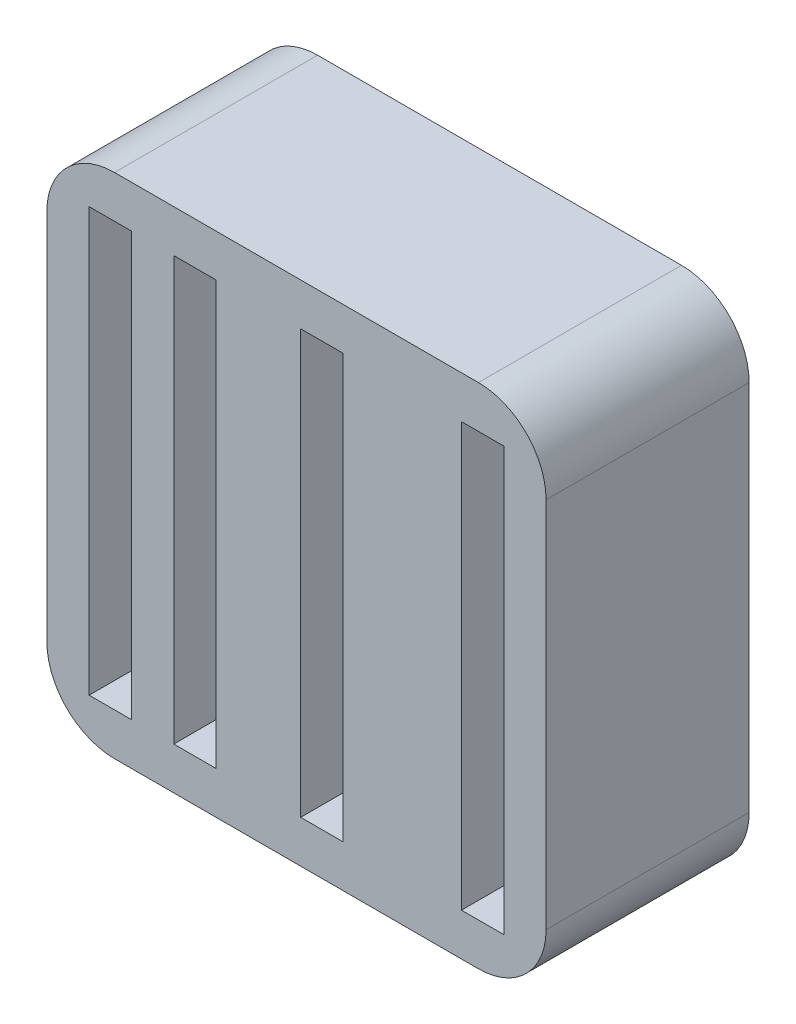
ISO-10303-21;
HEADER;
FILE_DESCRIPTION(('STEP AP214'),'2;1');
FILE_NAME('part.step','',(''),(''),'','','');
FILE_SCHEMA(('AUTOMOTIVE_DESIGN { 1 0 10303 214 1 1 1 1 }'));
ENDSEC;
DATA;
#1=APPLICATION_CONTEXT('core data for automotive mechanical design processes');
#2=APPLICATION_PROTOCOL_DEFINITION('international standard','automotive_design',2000,#1);
#3=PRODUCT_CONTEXT('',#1,'mechanical');
#4=PRODUCT('Part','Part','',(#3));
#5=PRODUCT_RELATED_PRODUCT_CATEGORY('part','',(#4));
#6=PRODUCT_DEFINITION_FORMATION('','',#4);
#7=PRODUCT_DEFINITION_CONTEXT('part definition',#1,'design');
#8=PRODUCT_DEFINITION('design','',#6,#7);
#9=PRODUCT_DEFINITION_SHAPE('','',#8);
#10=(LENGTH_UNIT() NAMED_UNIT(*) SI_UNIT(.MILLI.,.METRE.));
#11=(NAMED_UNIT(*) PLANE_ANGLE_UNIT() SI_UNIT($,.RADIAN.));
#12=(NAMED_UNIT(*) SI_UNIT($,.STERADIAN.) SOLID_ANGLE_UNIT());
#13=UNCERTAINTY_MEASURE_WITH_UNIT(LENGTH_MEASURE(1.E-05),#10,'distance_accuracy_value','');
#14=(GEOMETRIC_REPRESENTATION_CONTEXT(3) GLOBAL_UNCERTAINTY_ASSIGNED_CONTEXT((#13)) GLOBAL_UNIT_ASSIGNED_CONTEXT((#10,
#11,#12)) REPRESENTATION_CONTEXT('',''));
#15=CARTESIAN_POINT('',(0.,0.,0.));
#16=DIRECTION('',(0.,0.,1.));
#17=DIRECTION('',(1.,0.,0.));
#18=AXIS2_PLACEMENT_3D('',#15,#16,#17);
#19=CARTESIAN_POINT('',(-10.472049689441,0.,2.));
#20=DIRECTION('',(1.,0.,0.));
#21=DIRECTION('',(0.,1.,0.));
#22=AXIS2_PLACEMENT_3D('',#19,#20,#21);
#23=PLANE('',#22);
#24=DIRECTION('',(0.,-1.,0.));
#25=VECTOR('',#24,1.);
#26=CARTESIAN_POINT('',(-10.472049689441,0.,0.));
#27=LINE('',#26,#25);
#28=CARTESIAN_POINT('',(-10.472049689441,4.20186335403726,0.));
#29=VERTEX_POINT('',#28);
#30=CARTESIAN_POINT('',(-10.472049689441,-17.7981366459627,0.));
#31=VERTEX_POINT('',#30);
#32=EDGE_CURVE('E346',#29,#31,#27,.T.);
#33=ORIENTED_EDGE('',*,*,#32,.T.);
#34=DIRECTION('',(0.,0.,-1.));
#35=VECTOR('',#34,1.);
#36=CARTESIAN_POINT('',(-10.472049689441,-17.7981366459627,2.));
#37=LINE('',#36,#35);
#38=CARTESIAN_POINT('',(-10.472049689441,-17.7981366459627,12.));
#39=VERTEX_POINT('',#38);
#40=EDGE_CURVE('E52',#31,#39,#37,.F.);
#41=ORIENTED_EDGE('',*,*,#40,.T.);
#42=DIRECTION('',(0.,-1.,0.));
#43=VECTOR('',#42,1.);
#44=CARTESIAN_POINT('',(-10.472049689441,0.,12.));
#45=LINE('',#44,#43);
#46=CARTESIAN_POINT('',(-10.472049689441,4.20186335403726,12.));
#47=VERTEX_POINT('',#46);
#48=EDGE_CURVE('E236',#47,#39,#45,.T.);
#49=ORIENTED_EDGE('',*,*,#48,.F.);
#50=DIRECTION('',(0.,0.,-1.));
#51=VECTOR('',#50,1.);
#52=CARTESIAN_POINT('',(-10.472049689441,4.20186335403726,0.));
#53=LINE('',#52,#51);
#54=EDGE_CURVE('E382',#47,#29,#53,.T.);
#55=ORIENTED_EDGE('',*,*,#54,.T.);
#56=EDGE_LOOP('',(#33,#41,#49,#55));
#57=FACE_BOUND('',#56,.T.);
#58=ADVANCED_FACE('F37',(#57),#23,.F.);
#59=CARTESIAN_POINT('',(0.,-21.7981366459627,2.));
#60=DIRECTION('',(0.,1.,0.));
#61=DIRECTION('',(0.,0.,1.));
#62=AXIS2_PLACEMENT_3D('',#59,#60,#61);
#63=PLANE('',#62);
#64=DIRECTION('',(1.,0.,0.));
#65=VECTOR('',#64,1.);
#66=CARTESIAN_POINT('',(0.,-21.7981366459627,0.));
#67=LINE('',#66,#65);
#68=CARTESIAN_POINT('',(-6.47204968944099,-21.7981366459627,0.));
#69=VERTEX_POINT('',#68);
#70=CARTESIAN_POINT('',(15.027950310559,-21.7981366459627,0.));
#71=VERTEX_POINT('',#70);
#72=EDGE_CURVE('E348',#69,#71,#67,.T.);
#73=ORIENTED_EDGE('',*,*,#72,.T.);
#74=DIRECTION('',(0.,0.,-1.));
#75=VECTOR('',#74,1.);
#76=CARTESIAN_POINT('',(15.027950310559,-21.7981366459627,12.));
#77=LINE('',#76,#75);
#78=CARTESIAN_POINT('',(15.027950310559,-21.7981366459627,12.));
#79=VERTEX_POINT('',#78);
#80=EDGE_CURVE('E373',#71,#79,#77,.F.);
#81=ORIENTED_EDGE('',*,*,#80,.T.);
#82=DIRECTION('',(1.,0.,0.));
#83=VECTOR('',#82,1.);
#84=CARTESIAN_POINT('',(0.,-21.7981366459627,12.));
#85=LINE('',#84,#83);
#86=CARTESIAN_POINT('',(-6.47204968944099,-21.7981366459627,12.));
#87=VERTEX_POINT('',#86);
#88=EDGE_CURVE('E238',#87,#79,#85,.T.);
#89=ORIENTED_EDGE('',*,*,#88,.F.);
#90=DIRECTION('',(0.,0.,-1.));
#91=VECTOR('',#90,1.);
#92=CARTESIAN_POINT('',(-6.47204968944099,-21.7981366459627,2.));
#93=LINE('',#92,#91);
#94=EDGE_CURVE('E370',#87,#69,#93,.T.);
#95=ORIENTED_EDGE('',*,*,#94,.T.);
#96=EDGE_LOOP('',(#73,#81,#89,#95));
#97=FACE_BOUND('',#96,.T.);
#98=ADVANCED_FACE('F408',(#97),#63,.F.);
#99=CARTESIAN_POINT('',(19.027950310559,0.,2.));
#100=DIRECTION('',(1.,0.,0.));
#101=DIRECTION('',(0.,1.,0.));
#102=AXIS2_PLACEMENT_3D('',#99,#100,#101);
#103=PLANE('',#102);
#104=DIRECTION('',(0.,-1.,0.));
#105=VECTOR('',#104,1.);
#106=CARTESIAN_POINT('',(19.027950310559,0.,12.));
#107=LINE('',#106,#105);
#108=CARTESIAN_POINT('',(19.027950310559,4.20186335403727,12.));
#109=VERTEX_POINT('',#108);
#110=CARTESIAN_POINT('',(19.027950310559,-17.7981366459627,12.));
#111=VERTEX_POINT('',#110);
#112=EDGE_CURVE('E230',#109,#111,#107,.T.);
#113=ORIENTED_EDGE('',*,*,#112,.T.);
#114=DIRECTION('',(0.,0.,-1.));
#115=VECTOR('',#114,1.);
#116=CARTESIAN_POINT('',(19.027950310559,-17.7981366459627,0.));
#117=LINE('',#116,#115);
#118=CARTESIAN_POINT('',(19.027950310559,-17.7981366459627,0.));
#119=VERTEX_POINT('',#118);
#120=EDGE_CURVE('E359',#111,#119,#117,.T.);
#121=ORIENTED_EDGE('',*,*,#120,.T.);
#122=DIRECTION('',(0.,-1.,0.));
#123=VECTOR('',#122,1.);
#124=CARTESIAN_POINT('',(19.027950310559,0.,0.));
#125=LINE('',#124,#123);
#126=CARTESIAN_POINT('',(19.027950310559,4.20186335403727,0.));
#127=VERTEX_POINT('',#126);
#128=EDGE_CURVE('E351',#127,#119,#125,.T.);
#129=ORIENTED_EDGE('',*,*,#128,.F.);
#130=DIRECTION('',(0.,0.,-1.));
#131=VECTOR('',#130,1.);
#132=CARTESIAN_POINT('',(19.027950310559,4.20186335403727,2.));
#133=LINE('',#132,#131);
#134=EDGE_CURVE('E357',#127,#109,#133,.F.);
#135=ORIENTED_EDGE('',*,*,#134,.T.);
#136=EDGE_LOOP('',(#113,#121,#129,#135));
#137=FACE_BOUND('',#136,.T.);
#138=ADVANCED_FACE('F415',(#137),#103,.T.);
#139=CARTESIAN_POINT('',(0.,8.20186335403726,2.));
#140=DIRECTION('',(0.,1.,0.));
#141=DIRECTION('',(0.,0.,1.));
#142=AXIS2_PLACEMENT_3D('',#139,#140,#141);
#143=PLANE('',#142);
#144=DIRECTION('',(1.,0.,0.));
#145=VECTOR('',#144,1.);
#146=CARTESIAN_POINT('',(0.,8.20186335403726,0.));
#147=LINE('',#146,#145);
#148=CARTESIAN_POINT('',(-6.47204968944099,8.20186335403726,0.));
#149=VERTEX_POINT('',#148);
#150=CARTESIAN_POINT('',(15.027950310559,8.20186335403726,0.));
#151=VERTEX_POINT('',#150);
#152=EDGE_CURVE('E354',#149,#151,#147,.T.);
#153=ORIENTED_EDGE('',*,*,#152,.F.);
#154=DIRECTION('',(0.,0.,-1.));
#155=VECTOR('',#154,1.);
#156=CARTESIAN_POINT('',(-6.47204968944099,8.20186335403726,12.));
#157=LINE('',#156,#155);
#158=CARTESIAN_POINT('',(-6.47204968944099,8.20186335403726,12.));
#159=VERTEX_POINT('',#158);
#160=EDGE_CURVE('E11',#149,#159,#157,.F.);
#161=ORIENTED_EDGE('',*,*,#160,.T.);
#162=DIRECTION('',(1.,0.,0.));
#163=VECTOR('',#162,1.);
#164=CARTESIAN_POINT('',(0.,8.20186335403726,12.));
#165=LINE('',#164,#163);
#166=CARTESIAN_POINT('',(15.027950310559,8.20186335403726,12.));
#167=VERTEX_POINT('',#166);
#168=EDGE_CURVE('E233',#159,#167,#165,.T.);
#169=ORIENTED_EDGE('',*,*,#168,.T.);
#170=DIRECTION('',(0.,0.,-1.));
#171=VECTOR('',#170,1.);
#172=CARTESIAN_POINT('',(15.027950310559,8.20186335403726,2.));
#173=LINE('',#172,#171);
#174=EDGE_CURVE('E45',#167,#151,#173,.T.);
#175=ORIENTED_EDGE('',*,*,#174,.T.);
#176=EDGE_LOOP('',(#153,#161,#169,#175));
#177=FACE_BOUND('',#176,.T.);
#178=ADVANCED_FACE('F389',(#177),#143,.T.);
#179=CARTESIAN_POINT('',(0.,0.,0.));
#180=DIRECTION('',(0.,0.,1.));
#181=DIRECTION('',(1.,0.,0.));
#182=AXIS2_PLACEMENT_3D('',#179,#180,#181);
#183=PLANE('',#182);
#184=ORIENTED_EDGE('',*,*,#128,.T.);
#185=CARTESIAN_POINT('',(15.027950310559,-17.7981366459627,0.));
#186=DIRECTION('',(0.,0.,1.));
#187=DIRECTION('',(1.,0.,0.));
#188=AXIS2_PLACEMENT_3D('',#185,#186,#187);
#189=CIRCLE('',#188,4.);
#190=EDGE_CURVE('E368',#119,#71,#189,.F.);
#191=ORIENTED_EDGE('',*,*,#190,.T.);
#192=ORIENTED_EDGE('',*,*,#72,.F.);
#193=CARTESIAN_POINT('',(-6.47204968944099,-17.7981366459627,0.));
#194=DIRECTION('',(0.,0.,1.));
#195=DIRECTION('',(1.,0.,0.));
#196=AXIS2_PLACEMENT_3D('',#193,#194,#195);
#197=CIRCLE('',#196,4.);
#198=EDGE_CURVE('E366',#69,#31,#197,.F.);
#199=ORIENTED_EDGE('',*,*,#198,.T.);
#200=ORIENTED_EDGE('',*,*,#32,.F.);
#201=CARTESIAN_POINT('',(-6.47204968944099,4.20186335403726,0.));
#202=DIRECTION('',(0.,0.,1.));
#203=DIRECTION('',(1.,0.,0.));
#204=AXIS2_PLACEMENT_3D('',#201,#202,#203);
#205=CIRCLE('',#204,4.);
#206=EDGE_CURVE('E364',#29,#149,#205,.F.);
#207=ORIENTED_EDGE('',*,*,#206,.T.);
#208=ORIENTED_EDGE('',*,*,#152,.T.);
#209=CARTESIAN_POINT('',(15.027950310559,4.20186335403726,0.));
#210=DIRECTION('',(0.,0.,1.));
#211=DIRECTION('',(1.,0.,0.));
#212=AXIS2_PLACEMENT_3D('',#209,#210,#211);
#213=CIRCLE('',#212,4.);
#214=EDGE_CURVE('E362',#151,#127,#213,.F.);
#215=ORIENTED_EDGE('',*,*,#214,.T.);
#216=EDGE_LOOP('',(#184,#191,#192,#199,#200,#207,#208,#215));
#217=FACE_BOUND('',#216,.T.);
#218=ADVANCED_FACE('F394',(#217),#183,.F.);
#219=CARTESIAN_POINT('',(0.,5.70186335403726,12.));
#220=DIRECTION('',(0.,1.,0.));
#221=DIRECTION('',(0.,0.,1.));
#222=AXIS2_PLACEMENT_3D('',#219,#220,#221);
#223=PLANE('',#222);
#224=DIRECTION('',(-1.,0.,0.));
#225=VECTOR('',#224,1.);
#226=CARTESIAN_POINT('',(0.,5.70186335403726,2.));
#227=LINE('',#226,#225);
#228=CARTESIAN_POINT('',(-0.47204968944099,5.70186335403726,2.));
#229=VERTEX_POINT('',#228);
#230=CARTESIAN_POINT('',(-2.97204968944099,5.70186335403726,2.));
#231=VERTEX_POINT('',#230);
#232=EDGE_CURVE('E344',#229,#231,#227,.T.);
#233=ORIENTED_EDGE('',*,*,#232,.F.);
#234=DIRECTION('',(0.,0.,-1.));
#235=VECTOR('',#234,1.);
#236=CARTESIAN_POINT('',(-0.47204968944099,5.70186335403726,12.));
#237=LINE('',#236,#235);
#238=CARTESIAN_POINT('',(-0.47204968944099,5.70186335403726,12.));
#239=VERTEX_POINT('',#238);
#240=EDGE_CURVE('E278',#239,#229,#237,.T.);
#241=ORIENTED_EDGE('',*,*,#240,.F.);
#242=DIRECTION('',(1.,0.,0.));
#243=VECTOR('',#242,1.);
#244=CARTESIAN_POINT('',(0.,5.70186335403726,12.));
#245=LINE('',#244,#243);
#246=CARTESIAN_POINT('',(-2.97204968944099,5.70186335403726,12.));
#247=VERTEX_POINT('',#246);
#248=EDGE_CURVE('E221',#247,#239,#245,.T.);
#249=ORIENTED_EDGE('',*,*,#248,.F.);
#250=DIRECTION('',(0.,0.,-1.));
#251=VECTOR('',#250,1.);
#252=CARTESIAN_POINT('',(-2.97204968944099,5.70186335403726,12.));
#253=LINE('',#252,#251);
#254=EDGE_CURVE('E268',#247,#231,#253,.T.);
#255=ORIENTED_EDGE('',*,*,#254,.T.);
#256=EDGE_LOOP('',(#233,#241,#249,#255));
#257=FACE_BOUND('',#256,.T.);
#258=ADVANCED_FACE('F532',(#257),#223,.F.);
#259=CARTESIAN_POINT('',(-0.472049689440989,0.,12.));
#260=DIRECTION('',(1.,0.,0.));
#261=DIRECTION('',(0.,1.,0.));
#262=AXIS2_PLACEMENT_3D('',#259,#260,#261);
#263=PLANE('',#262);
#264=DIRECTION('',(0.,1.,0.));
#265=VECTOR('',#264,1.);
#266=CARTESIAN_POINT('',(-0.472049689440989,0.,2.));
#267=LINE('',#266,#265);
#268=CARTESIAN_POINT('',(-0.472049689440987,-19.2981366459627,2.));
#269=VERTEX_POINT('',#268);
#270=EDGE_CURVE('E342',#269,#229,#267,.T.);
#271=ORIENTED_EDGE('',*,*,#270,.F.);
#272=DIRECTION('',(0.,0.,-1.));
#273=VECTOR('',#272,1.);
#274=CARTESIAN_POINT('',(-0.472049689440987,-19.2981366459627,12.));
#275=LINE('',#274,#273);
#276=CARTESIAN_POINT('',(-0.472049689440987,-19.2981366459627,12.));
#277=VERTEX_POINT('',#276);
#278=EDGE_CURVE('E275',#277,#269,#275,.T.);
#279=ORIENTED_EDGE('',*,*,#278,.F.);
#280=DIRECTION('',(0.,-1.,0.));
#281=VECTOR('',#280,1.);
#282=CARTESIAN_POINT('',(-0.472049689440989,0.,12.));
#283=LINE('',#282,#281);
#284=EDGE_CURVE('E259',#239,#277,#283,.T.);
#285=ORIENTED_EDGE('',*,*,#284,.F.);
#286=ORIENTED_EDGE('',*,*,#240,.T.);
#287=EDGE_LOOP('',(#271,#279,#285,#286));
#288=FACE_BOUND('',#287,.T.);
#289=ADVANCED_FACE('F608',(#288),#263,.F.);
#290=CARTESIAN_POINT('',(0.,-19.2981366459627,12.));
#291=DIRECTION('',(0.,1.,0.));
#292=DIRECTION('',(0.,0.,1.));
#293=AXIS2_PLACEMENT_3D('',#290,#291,#292);
#294=PLANE('',#293);
#295=ORIENTED_EDGE('',*,*,#278,.T.);
#296=DIRECTION('',(-1.,0.,0.));
#297=VECTOR('',#296,1.);
#298=CARTESIAN_POINT('',(0.,-19.2981366459627,2.));
#299=LINE('',#298,#297);
#300=CARTESIAN_POINT('',(-2.97204968944099,-19.2981366459627,2.));
#301=VERTEX_POINT('',#300);
#302=EDGE_CURVE('E339',#269,#301,#299,.T.);
#303=ORIENTED_EDGE('',*,*,#302,.T.);
#304=DIRECTION('',(0.,0.,-1.));
#305=VECTOR('',#304,1.);
#306=CARTESIAN_POINT('',(-2.97204968944099,-19.2981366459627,12.));
#307=LINE('',#306,#305);
#308=CARTESIAN_POINT('',(-2.97204968944099,-19.2981366459627,12.));
#309=VERTEX_POINT('',#308);
#310=EDGE_CURVE('E271',#309,#301,#307,.T.);
#311=ORIENTED_EDGE('',*,*,#310,.F.);
#312=DIRECTION('',(1.,0.,0.));
#313=VECTOR('',#312,1.);
#314=CARTESIAN_POINT('',(0.,-19.2981366459627,12.));
#315=LINE('',#314,#313);
#316=EDGE_CURVE('E261',#309,#277,#315,.T.);
#317=ORIENTED_EDGE('',*,*,#316,.T.);
#318=EDGE_LOOP('',(#295,#303,#311,#317));
#319=FACE_BOUND('',#318,.T.);
#320=ADVANCED_FACE('F598',(#319),#294,.T.);
#321=CARTESIAN_POINT('',(4.52795031055901,0.,12.));
#322=DIRECTION('',(-1.,0.,0.));
#323=DIRECTION('',(0.,0.,1.));
#324=AXIS2_PLACEMENT_3D('',#321,#322,#323);
#325=PLANE('',#324);
#326=DIRECTION('',(0.,-1.,0.));
#327=VECTOR('',#326,1.);
#328=CARTESIAN_POINT('',(4.52795031055901,0.,2.));
#329=LINE('',#328,#327);
#330=CARTESIAN_POINT('',(4.52795031055901,5.70186335403726,2.));
#331=VERTEX_POINT('',#330);
#332=CARTESIAN_POINT('',(4.52795031055901,-19.2981366459627,2.));
#333=VERTEX_POINT('',#332);
#334=EDGE_CURVE('E337',#331,#333,#329,.T.);
#335=ORIENTED_EDGE('',*,*,#334,.F.);
#336=DIRECTION('',(0.,0.,-1.));
#337=VECTOR('',#336,1.);
#338=CARTESIAN_POINT('',(4.52795031055901,5.70186335403726,12.));
#339=LINE('',#338,#337);
#340=CARTESIAN_POINT('',(4.52795031055901,5.70186335403726,12.));
#341=VERTEX_POINT('',#340);
#342=EDGE_CURVE('E272',#341,#331,#339,.T.);
#343=ORIENTED_EDGE('',*,*,#342,.F.);
#344=DIRECTION('',(0.,1.,0.));
#345=VECTOR('',#344,1.);
#346=CARTESIAN_POINT('',(4.52795031055901,0.,12.));
#347=LINE('',#346,#345);
#348=CARTESIAN_POINT('',(4.52795031055901,-19.2981366459627,12.));
#349=VERTEX_POINT('',#348);
#350=EDGE_CURVE('E249',#349,#341,#347,.T.);
#351=ORIENTED_EDGE('',*,*,#350,.F.);
#352=DIRECTION('',(0.,0.,-1.));
#353=VECTOR('',#352,1.);
#354=CARTESIAN_POINT('',(4.52795031055901,-19.2981366459627,12.));
#355=LINE('',#354,#353);
#356=EDGE_CURVE('E282',#349,#333,#355,.T.);
#357=ORIENTED_EDGE('',*,*,#356,.T.);
#358=EDGE_LOOP('',(#335,#343,#351,#357));
#359=FACE_BOUND('',#358,.T.);
#360=ADVANCED_FACE('F589',(#359),#325,.F.);
#361=DIRECTION('',(-1.,0.,0.));
#362=VECTOR('',#361,1.);
#363=CARTESIAN_POINT('',(0.,5.70186335403726,2.));
#364=LINE('',#363,#362);
#365=CARTESIAN_POINT('',(7.02795031055901,5.70186335403726,2.));
#366=VERTEX_POINT('',#365);
#367=EDGE_CURVE('E335',#366,#331,#364,.T.);
#368=ORIENTED_EDGE('',*,*,#367,.F.);
#369=DIRECTION('',(0.,0.,-1.));
#370=VECTOR('',#369,1.);
#371=CARTESIAN_POINT('',(7.02795031055901,5.70186335403726,12.));
#372=LINE('',#371,#370);
#373=CARTESIAN_POINT('',(7.02795031055901,5.70186335403726,12.));
#374=VERTEX_POINT('',#373);
#375=EDGE_CURVE('E289',#374,#366,#372,.T.);
#376=ORIENTED_EDGE('',*,*,#375,.F.);
#377=EDGE_CURVE('E252',#341,#374,#245,.T.);
#378=ORIENTED_EDGE('',*,*,#377,.F.);
#379=ORIENTED_EDGE('',*,*,#342,.T.);
#380=EDGE_LOOP('',(#368,#376,#378,#379));
#381=FACE_BOUND('',#380,.T.);
#382=ADVANCED_FACE('F561',(#381),#223,.F.);
#383=CARTESIAN_POINT('',(7.02795031055901,0.,12.));
#384=DIRECTION('',(-1.,0.,0.));
#385=DIRECTION('',(0.,0.,1.));
#386=AXIS2_PLACEMENT_3D('',#383,#384,#385);
#387=PLANE('',#386);
#388=ORIENTED_EDGE('',*,*,#375,.T.);
#389=DIRECTION('',(0.,-1.,0.));
#390=VECTOR('',#389,1.);
#391=CARTESIAN_POINT('',(7.02795031055901,0.,2.));
#392=LINE('',#391,#390);
#393=CARTESIAN_POINT('',(7.02795031055901,-19.2981366459627,2.));
#394=VERTEX_POINT('',#393);
#395=EDGE_CURVE('E332',#366,#394,#392,.T.);
#396=ORIENTED_EDGE('',*,*,#395,.T.);
#397=DIRECTION('',(0.,0.,-1.));
#398=VECTOR('',#397,1.);
#399=CARTESIAN_POINT('',(7.02795031055901,-19.2981366459627,12.));
#400=LINE('',#399,#398);
#401=CARTESIAN_POINT('',(7.02795031055901,-19.2981366459627,12.));
#402=VERTEX_POINT('',#401);
#403=EDGE_CURVE('E285',#402,#394,#400,.T.);
#404=ORIENTED_EDGE('',*,*,#403,.F.);
#405=DIRECTION('',(0.,1.,0.));
#406=VECTOR('',#405,1.);
#407=CARTESIAN_POINT('',(7.02795031055901,0.,12.));
#408=LINE('',#407,#406);
#409=EDGE_CURVE('E253',#402,#374,#408,.T.);
#410=ORIENTED_EDGE('',*,*,#409,.T.);
#411=EDGE_LOOP('',(#388,#396,#404,#410));
#412=FACE_BOUND('',#411,.T.);
#413=ADVANCED_FACE('F569',(#412),#387,.T.);
#414=CARTESIAN_POINT('',(14.027950310559,0.,12.));
#415=DIRECTION('',(1.,0.,0.));
#416=DIRECTION('',(0.,1.,0.));
#417=AXIS2_PLACEMENT_3D('',#414,#415,#416);
#418=PLANE('',#417);
#419=DIRECTION('',(0.,0.,-1.));
#420=VECTOR('',#419,1.);
#421=CARTESIAN_POINT('',(14.027950310559,-19.2981366459627,12.));
#422=LINE('',#421,#420);
#423=CARTESIAN_POINT('',(14.027950310559,-19.2981366459627,12.));
#424=VERTEX_POINT('',#423);
#425=CARTESIAN_POINT('',(14.027950310559,-19.2981366459627,2.));
#426=VERTEX_POINT('',#425);
#427=EDGE_CURVE('E210',#424,#426,#422,.T.);
#428=ORIENTED_EDGE('',*,*,#427,.T.);
#429=DIRECTION('',(0.,1.,0.));
#430=VECTOR('',#429,1.);
#431=CARTESIAN_POINT('',(14.027950310559,0.,2.));
#432=LINE('',#431,#430);
#433=CARTESIAN_POINT('',(14.027950310559,5.70186335403726,2.));
#434=VERTEX_POINT('',#433);
#435=EDGE_CURVE('E329',#426,#434,#432,.T.);
#436=ORIENTED_EDGE('',*,*,#435,.T.);
#437=DIRECTION('',(0.,0.,-1.));
#438=VECTOR('',#437,1.);
#439=CARTESIAN_POINT('',(14.027950310559,5.70186335403726,12.));
#440=LINE('',#439,#438);
#441=CARTESIAN_POINT('',(14.027950310559,5.70186335403726,12.));
#442=VERTEX_POINT('',#441);
#443=EDGE_CURVE('E286',#442,#434,#440,.T.);
#444=ORIENTED_EDGE('',*,*,#443,.F.);
#445=DIRECTION('',(0.,-1.,0.));
#446=VECTOR('',#445,1.);
#447=CARTESIAN_POINT('',(14.027950310559,0.,12.));
#448=LINE('',#447,#446);
#449=EDGE_CURVE('E241',#442,#424,#448,.T.);
#450=ORIENTED_EDGE('',*,*,#449,.T.);
#451=EDGE_LOOP('',(#428,#436,#444,#450));
#452=FACE_BOUND('',#451,.T.);
#453=ADVANCED_FACE('F559',(#452),#418,.T.);
#454=DIRECTION('',(-1.,0.,0.));
#455=VECTOR('',#454,1.);
#456=CARTESIAN_POINT('',(0.,5.70186335403726,2.));
#457=LINE('',#456,#455);
#458=CARTESIAN_POINT('',(16.527950310559,5.70186335403726,2.));
#459=VERTEX_POINT('',#458);
#460=EDGE_CURVE('E327',#459,#434,#457,.T.);
#461=ORIENTED_EDGE('',*,*,#460,.F.);
#462=DIRECTION('',(0.,0.,-1.));
#463=VECTOR('',#462,1.);
#464=CARTESIAN_POINT('',(16.527950310559,5.70186335403726,12.));
#465=LINE('',#464,#463);
#466=CARTESIAN_POINT('',(16.527950310559,5.70186335403726,12.));
#467=VERTEX_POINT('',#466);
#468=EDGE_CURVE('E299',#467,#459,#465,.T.);
#469=ORIENTED_EDGE('',*,*,#468,.F.);
#470=EDGE_CURVE('E222',#442,#467,#245,.T.);
#471=ORIENTED_EDGE('',*,*,#470,.F.);
#472=ORIENTED_EDGE('',*,*,#443,.T.);
#473=EDGE_LOOP('',(#461,#469,#471,#472));
#474=FACE_BOUND('',#473,.T.);
#475=ADVANCED_FACE('F531',(#474),#223,.F.);
#476=CARTESIAN_POINT('',(16.527950310559,0.,12.));
#477=DIRECTION('',(1.,0.,0.));
#478=DIRECTION('',(0.,1.,0.));
#479=AXIS2_PLACEMENT_3D('',#476,#477,#478);
#480=PLANE('',#479);
#481=DIRECTION('',(0.,1.,0.));
#482=VECTOR('',#481,1.);
#483=CARTESIAN_POINT('',(16.527950310559,0.,2.));
#484=LINE('',#483,#482);
#485=CARTESIAN_POINT('',(16.527950310559,-19.2981366459627,2.));
#486=VERTEX_POINT('',#485);
#487=EDGE_CURVE('E325',#486,#459,#484,.T.);
#488=ORIENTED_EDGE('',*,*,#487,.F.);
#489=DIRECTION('',(0.,0.,-1.));
#490=VECTOR('',#489,1.);
#491=CARTESIAN_POINT('',(16.527950310559,-19.2981366459627,12.));
#492=LINE('',#491,#490);
#493=CARTESIAN_POINT('',(16.527950310559,-19.2981366459627,12.));
#494=VERTEX_POINT('',#493);
#495=EDGE_CURVE('E296',#494,#486,#492,.T.);
#496=ORIENTED_EDGE('',*,*,#495,.F.);
#497=DIRECTION('',(0.,-1.,0.));
#498=VECTOR('',#497,1.);
#499=CARTESIAN_POINT('',(16.527950310559,0.,12.));
#500=LINE('',#499,#498);
#501=EDGE_CURVE('E244',#467,#494,#500,.T.);
#502=ORIENTED_EDGE('',*,*,#501,.F.);
#503=ORIENTED_EDGE('',*,*,#468,.T.);
#504=EDGE_LOOP('',(#488,#496,#502,#503));
#505=FACE_BOUND('',#504,.T.);
#506=ADVANCED_FACE('F540',(#505),#480,.F.);
#507=CARTESIAN_POINT('',(-7.97204968944099,0.,12.));
#508=DIRECTION('',(1.,0.,0.));
#509=DIRECTION('',(0.,1.,0.));
#510=AXIS2_PLACEMENT_3D('',#507,#508,#509);
#511=PLANE('',#510);
#512=DIRECTION('',(0.,0.,-1.));
#513=VECTOR('',#512,1.);
#514=CARTESIAN_POINT('',(-7.97204968944099,-19.2981366459627,12.));
#515=LINE('',#514,#513);
#516=CARTESIAN_POINT('',(-7.97204968944099,-19.2981366459627,12.));
#517=VERTEX_POINT('',#516);
#518=CARTESIAN_POINT('',(-7.97204968944099,-19.2981366459627,2.));
#519=VERTEX_POINT('',#518);
#520=EDGE_CURVE('E267',#517,#519,#515,.T.);
#521=ORIENTED_EDGE('',*,*,#520,.T.);
#522=DIRECTION('',(0.,1.,0.));
#523=VECTOR('',#522,1.);
#524=CARTESIAN_POINT('',(-7.97204968944099,0.,2.));
#525=LINE('',#524,#523);
#526=CARTESIAN_POINT('',(-7.97204968944099,5.70186335403726,2.));
#527=VERTEX_POINT('',#526);
#528=EDGE_CURVE('E207',#519,#527,#525,.T.);
#529=ORIENTED_EDGE('',*,*,#528,.T.);
#530=DIRECTION('',(0.,0.,-1.));
#531=VECTOR('',#530,1.);
#532=CARTESIAN_POINT('',(-7.97204968944099,5.70186335403726,12.));
#533=LINE('',#532,#531);
#534=CARTESIAN_POINT('',(-7.97204968944099,5.70186335403726,12.));
#535=VERTEX_POINT('',#534);
#536=EDGE_CURVE('E200',#535,#527,#533,.T.);
#537=ORIENTED_EDGE('',*,*,#536,.F.);
#538=DIRECTION('',(0.,-1.,0.));
#539=VECTOR('',#538,1.);
#540=CARTESIAN_POINT('',(-7.97204968944099,0.,12.));
#541=LINE('',#540,#539);
#542=EDGE_CURVE('E205',#535,#517,#541,.T.);
#543=ORIENTED_EDGE('',*,*,#542,.T.);
#544=EDGE_LOOP('',(#521,#529,#537,#543));
#545=FACE_BOUND('',#544,.T.);
#546=ADVANCED_FACE('F203',(#545),#511,.T.);
#547=DIRECTION('',(-1.,0.,0.));
#548=VECTOR('',#547,1.);
#549=CARTESIAN_POINT('',(0.,5.70186335403726,2.));
#550=LINE('',#549,#548);
#551=CARTESIAN_POINT('',(-5.47204968944099,5.70186335403726,2.));
#552=VERTEX_POINT('',#551);
#553=EDGE_CURVE('E322',#552,#527,#550,.T.);
#554=ORIENTED_EDGE('',*,*,#553,.F.);
#555=DIRECTION('',(0.,0.,-1.));
#556=VECTOR('',#555,1.);
#557=CARTESIAN_POINT('',(-5.47204968944099,5.70186335403726,12.));
#558=LINE('',#557,#556);
#559=CARTESIAN_POINT('',(-5.47204968944099,5.70186335403726,12.));
#560=VERTEX_POINT('',#559);
#561=EDGE_CURVE('E211',#560,#552,#558,.T.);
#562=ORIENTED_EDGE('',*,*,#561,.F.);
#563=EDGE_CURVE('E214',#535,#560,#245,.T.);
#564=ORIENTED_EDGE('',*,*,#563,.F.);
#565=ORIENTED_EDGE('',*,*,#536,.T.);
#566=EDGE_LOOP('',(#554,#562,#564,#565));
#567=FACE_BOUND('',#566,.T.);
#568=ADVANCED_FACE('F215',(#567),#223,.F.);
#569=CARTESIAN_POINT('',(-5.47204968944099,0.,12.));
#570=DIRECTION('',(1.,0.,0.));
#571=DIRECTION('',(0.,1.,0.));
#572=AXIS2_PLACEMENT_3D('',#569,#570,#571);
#573=PLANE('',#572);
#574=DIRECTION('',(0.,1.,0.));
#575=VECTOR('',#574,1.);
#576=CARTESIAN_POINT('',(-5.47204968944099,0.,2.));
#577=LINE('',#576,#575);
#578=CARTESIAN_POINT('',(-5.47204968944099,-19.2981366459627,2.));
#579=VERTEX_POINT('',#578);
#580=EDGE_CURVE('E320',#579,#552,#577,.T.);
#581=ORIENTED_EDGE('',*,*,#580,.F.);
#582=DIRECTION('',(0.,0.,-1.));
#583=VECTOR('',#582,1.);
#584=CARTESIAN_POINT('',(-5.47204968944099,-19.2981366459627,12.));
#585=LINE('',#584,#583);
#586=CARTESIAN_POINT('',(-5.47204968944099,-19.2981366459627,12.));
#587=VERTEX_POINT('',#586);
#588=EDGE_CURVE('E305',#587,#579,#585,.T.);
#589=ORIENTED_EDGE('',*,*,#588,.F.);
#590=DIRECTION('',(0.,-1.,0.));
#591=VECTOR('',#590,1.);
#592=CARTESIAN_POINT('',(-5.47204968944099,0.,12.));
#593=LINE('',#592,#591);
#594=EDGE_CURVE('E219',#560,#587,#593,.T.);
#595=ORIENTED_EDGE('',*,*,#594,.F.);
#596=ORIENTED_EDGE('',*,*,#561,.T.);
#597=EDGE_LOOP('',(#581,#589,#595,#596));
#598=FACE_BOUND('',#597,.T.);
#599=ADVANCED_FACE('F510',(#598),#573,.F.);
#600=CARTESIAN_POINT('',(0.,-19.2981366459627,12.));
#601=DIRECTION('',(0.,1.,0.));
#602=DIRECTION('',(-1.,0.,0.));
#603=AXIS2_PLACEMENT_3D('',#600,#601,#602);
#604=PLANE('',#603);
#605=ORIENTED_EDGE('',*,*,#403,.T.);
#606=DIRECTION('',(-1.,0.,0.));
#607=VECTOR('',#606,1.);
#608=CARTESIAN_POINT('',(0.,-19.2981366459627,2.));
#609=LINE('',#608,#607);
#610=EDGE_CURVE('E317',#394,#333,#609,.T.);
#611=ORIENTED_EDGE('',*,*,#610,.T.);
#612=ORIENTED_EDGE('',*,*,#356,.F.);
#613=DIRECTION('',(1.,0.,0.));
#614=VECTOR('',#613,1.);
#615=CARTESIAN_POINT('',(0.,-19.2981366459627,12.));
#616=LINE('',#615,#614);
#617=EDGE_CURVE('E256',#349,#402,#616,.T.);
#618=ORIENTED_EDGE('',*,*,#617,.T.);
#619=EDGE_LOOP('',(#605,#611,#612,#618));
#620=FACE_BOUND('',#619,.T.);
#621=ADVANCED_FACE('F500',(#620),#604,.T.);
#622=CARTESIAN_POINT('',(0.,-19.2981366459627,12.));
#623=DIRECTION('',(0.,1.,0.));
#624=DIRECTION('',(0.,0.,1.));
#625=AXIS2_PLACEMENT_3D('',#622,#623,#624);
#626=PLANE('',#625);
#627=ORIENTED_EDGE('',*,*,#495,.T.);
#628=DIRECTION('',(-1.,0.,0.));
#629=VECTOR('',#628,1.);
#630=CARTESIAN_POINT('',(0.,-19.2981366459627,2.));
#631=LINE('',#630,#629);
#632=EDGE_CURVE('E314',#486,#426,#631,.T.);
#633=ORIENTED_EDGE('',*,*,#632,.T.);
#634=ORIENTED_EDGE('',*,*,#427,.F.);
#635=DIRECTION('',(1.,0.,0.));
#636=VECTOR('',#635,1.);
#637=CARTESIAN_POINT('',(0.,-19.2981366459627,12.));
#638=LINE('',#637,#636);
#639=EDGE_CURVE('E246',#424,#494,#638,.T.);
#640=ORIENTED_EDGE('',*,*,#639,.T.);
#641=EDGE_LOOP('',(#627,#633,#634,#640));
#642=FACE_BOUND('',#641,.T.);
#643=ADVANCED_FACE('F490',(#642),#626,.T.);
#644=CARTESIAN_POINT('',(0.,-19.2981366459627,12.));
#645=DIRECTION('',(0.,1.,0.));
#646=DIRECTION('',(0.,0.,1.));
#647=AXIS2_PLACEMENT_3D('',#644,#645,#646);
#648=PLANE('',#647);
#649=ORIENTED_EDGE('',*,*,#588,.T.);
#650=DIRECTION('',(-1.,0.,0.));
#651=VECTOR('',#650,1.);
#652=CARTESIAN_POINT('',(0.,-19.2981366459627,2.));
#653=LINE('',#652,#651);
#654=EDGE_CURVE('E311',#579,#519,#653,.T.);
#655=ORIENTED_EDGE('',*,*,#654,.T.);
#656=ORIENTED_EDGE('',*,*,#520,.F.);
#657=DIRECTION('',(1.,0.,0.));
#658=VECTOR('',#657,1.);
#659=CARTESIAN_POINT('',(0.,-19.2981366459627,12.));
#660=LINE('',#659,#658);
#661=EDGE_CURVE('E225',#517,#587,#660,.T.);
#662=ORIENTED_EDGE('',*,*,#661,.T.);
#663=EDGE_LOOP('',(#649,#655,#656,#662));
#664=FACE_BOUND('',#663,.T.);
#665=ADVANCED_FACE('F480',(#664),#648,.T.);
#666=CARTESIAN_POINT('',(-2.97204968944099,0.,12.));
#667=DIRECTION('',(1.,0.,0.));
#668=DIRECTION('',(0.,1.,0.));
#669=AXIS2_PLACEMENT_3D('',#666,#667,#668);
#670=PLANE('',#669);
#671=ORIENTED_EDGE('',*,*,#310,.T.);
#672=DIRECTION('',(0.,1.,0.));
#673=VECTOR('',#672,1.);
#674=CARTESIAN_POINT('',(-2.97204968944099,0.,2.));
#675=LINE('',#674,#673);
#676=EDGE_CURVE('E281',#301,#231,#675,.T.);
#677=ORIENTED_EDGE('',*,*,#676,.T.);
#678=ORIENTED_EDGE('',*,*,#254,.F.);
#679=DIRECTION('',(0.,-1.,0.));
#680=VECTOR('',#679,1.);
#681=CARTESIAN_POINT('',(-2.97204968944099,0.,12.));
#682=LINE('',#681,#680);
#683=EDGE_CURVE('E264',#247,#309,#682,.T.);
#684=ORIENTED_EDGE('',*,*,#683,.T.);
#685=EDGE_LOOP('',(#671,#677,#678,#684));
#686=FACE_BOUND('',#685,.T.);
#687=ADVANCED_FACE('F471',(#686),#670,.T.);
#688=CARTESIAN_POINT('',(0.,0.,12.));
#689=DIRECTION('',(0.,0.,1.));
#690=DIRECTION('',(1.,0.,0.));
#691=AXIS2_PLACEMENT_3D('',#688,#689,#690);
#692=PLANE('',#691);
#693=ORIENTED_EDGE('',*,*,#542,.F.);
#694=ORIENTED_EDGE('',*,*,#563,.T.);
#695=ORIENTED_EDGE('',*,*,#594,.T.);
#696=ORIENTED_EDGE('',*,*,#661,.F.);
#697=EDGE_LOOP('',(#693,#694,#695,#696));
#698=FACE_BOUND('',#697,.T.);
#699=ORIENTED_EDGE('',*,*,#88,.T.);
#700=CARTESIAN_POINT('',(15.027950310559,-17.7981366459627,12.));
#701=DIRECTION('',(0.,0.,1.));
#702=DIRECTION('',(1.,0.,0.));
#703=AXIS2_PLACEMENT_3D('',#700,#701,#702);
#704=CIRCLE('',#703,4.);
#705=EDGE_CURVE('E380',#79,#111,#704,.T.);
#706=ORIENTED_EDGE('',*,*,#705,.T.);
#707=ORIENTED_EDGE('',*,*,#112,.F.);
#708=CARTESIAN_POINT('',(15.027950310559,4.20186335403726,12.));
#709=DIRECTION('',(0.,0.,1.));
#710=DIRECTION('',(1.,0.,0.));
#711=AXIS2_PLACEMENT_3D('',#708,#709,#710);
#712=CIRCLE('',#711,4.);
#713=EDGE_CURVE('E375',#109,#167,#712,.T.);
#714=ORIENTED_EDGE('',*,*,#713,.T.);
#715=ORIENTED_EDGE('',*,*,#168,.F.);
#716=CARTESIAN_POINT('',(-6.47204968944099,4.20186335403726,12.));
#717=DIRECTION('',(0.,0.,1.));
#718=DIRECTION('',(1.,0.,0.));
#719=AXIS2_PLACEMENT_3D('',#716,#717,#718);
#720=CIRCLE('',#719,4.);
#721=EDGE_CURVE('E59',#159,#47,#720,.T.);
#722=ORIENTED_EDGE('',*,*,#721,.T.);
#723=ORIENTED_EDGE('',*,*,#48,.T.);
#724=CARTESIAN_POINT('',(-6.47204968944099,-17.7981366459627,12.));
#725=DIRECTION('',(0.,0.,1.));
#726=DIRECTION('',(1.,0.,0.));
#727=AXIS2_PLACEMENT_3D('',#724,#725,#726);
#728=CIRCLE('',#727,4.);
#729=EDGE_CURVE('E378',#39,#87,#728,.T.);
#730=ORIENTED_EDGE('',*,*,#729,.T.);
#731=EDGE_LOOP('',(#699,#706,#707,#714,#715,#722,#723,#730));
#732=FACE_BOUND('',#731,.T.);
#733=ORIENTED_EDGE('',*,*,#449,.F.);
#734=ORIENTED_EDGE('',*,*,#470,.T.);
#735=ORIENTED_EDGE('',*,*,#501,.T.);
#736=ORIENTED_EDGE('',*,*,#639,.F.);
#737=EDGE_LOOP('',(#733,#734,#735,#736));
#738=FACE_BOUND('',#737,.T.);
#739=ORIENTED_EDGE('',*,*,#350,.T.);
#740=ORIENTED_EDGE('',*,*,#377,.T.);
#741=ORIENTED_EDGE('',*,*,#409,.F.);
#742=ORIENTED_EDGE('',*,*,#617,.F.);
#743=EDGE_LOOP('',(#739,#740,#741,#742));
#744=FACE_BOUND('',#743,.T.);
#745=ORIENTED_EDGE('',*,*,#248,.T.);
#746=ORIENTED_EDGE('',*,*,#284,.T.);
#747=ORIENTED_EDGE('',*,*,#316,.F.);
#748=ORIENTED_EDGE('',*,*,#683,.F.);
#749=EDGE_LOOP('',(#745,#746,#747,#748));
#750=FACE_BOUND('',#749,.T.);
#751=ADVANCED_FACE('F223',(#698,#732,#738,#744,#750),#692,.T.);
#752=CARTESIAN_POINT('',(0.,0.,2.));
#753=DIRECTION('',(0.,0.,1.));
#754=DIRECTION('',(1.,0.,0.));
#755=AXIS2_PLACEMENT_3D('',#752,#753,#754);
#756=PLANE('',#755);
#757=ORIENTED_EDGE('',*,*,#270,.T.);
#758=ORIENTED_EDGE('',*,*,#232,.T.);
#759=ORIENTED_EDGE('',*,*,#676,.F.);
#760=ORIENTED_EDGE('',*,*,#302,.F.);
#761=EDGE_LOOP('',(#757,#758,#759,#760));
#762=FACE_BOUND('',#761,.T.);
#763=ADVANCED_FACE('F470',(#762),#756,.T.);
#764=ORIENTED_EDGE('',*,*,#528,.F.);
#765=ORIENTED_EDGE('',*,*,#654,.F.);
#766=ORIENTED_EDGE('',*,*,#580,.T.);
#767=ORIENTED_EDGE('',*,*,#553,.T.);
#768=EDGE_LOOP('',(#764,#765,#766,#767));
#769=FACE_BOUND('',#768,.T.);
#770=ADVANCED_FACE('F640',(#769),#756,.T.);
#771=ORIENTED_EDGE('',*,*,#435,.F.);
#772=ORIENTED_EDGE('',*,*,#632,.F.);
#773=ORIENTED_EDGE('',*,*,#487,.T.);
#774=ORIENTED_EDGE('',*,*,#460,.T.);
#775=EDGE_LOOP('',(#771,#772,#773,#774));
#776=FACE_BOUND('',#775,.T.);
#777=ADVANCED_FACE('F637',(#776),#756,.T.);
#778=ORIENTED_EDGE('',*,*,#367,.T.);
#779=ORIENTED_EDGE('',*,*,#334,.T.);
#780=ORIENTED_EDGE('',*,*,#610,.F.);
#781=ORIENTED_EDGE('',*,*,#395,.F.);
#782=EDGE_LOOP('',(#778,#779,#780,#781));
#783=FACE_BOUND('',#782,.T.);
#784=ADVANCED_FACE('F432',(#783),#756,.T.);
#785=CARTESIAN_POINT('',(15.027950310559,-17.7981366459627,2.));
#786=DIRECTION('',(0.,0.,1.));
#787=DIRECTION('',(1.,0.,0.));
#788=AXIS2_PLACEMENT_3D('',#785,#786,#787);
#789=CYLINDRICAL_SURFACE('',#788,4.);
#790=ORIENTED_EDGE('',*,*,#705,.F.);
#791=ORIENTED_EDGE('',*,*,#80,.F.);
#792=ORIENTED_EDGE('',*,*,#190,.F.);
#793=ORIENTED_EDGE('',*,*,#120,.F.);
#794=EDGE_LOOP('',(#790,#791,#792,#793));
#795=FACE_BOUND('',#794,.T.);
#796=ADVANCED_FACE('F413',(#795),#789,.T.);
#797=CARTESIAN_POINT('',(-6.47204968944099,-17.7981366459627,2.));
#798=DIRECTION('',(0.,0.,-1.));
#799=DIRECTION('',(-1.,0.,0.));
#800=AXIS2_PLACEMENT_3D('',#797,#798,#799);
#801=CYLINDRICAL_SURFACE('',#800,4.);
#802=ORIENTED_EDGE('',*,*,#729,.F.);
#803=ORIENTED_EDGE('',*,*,#40,.F.);
#804=ORIENTED_EDGE('',*,*,#198,.F.);
#805=ORIENTED_EDGE('',*,*,#94,.F.);
#806=EDGE_LOOP('',(#802,#803,#804,#805));
#807=FACE_BOUND('',#806,.T.);
#808=ADVANCED_FACE('F405',(#807),#801,.T.);
#809=CARTESIAN_POINT('',(-6.47204968944099,4.20186335403726,2.));
#810=DIRECTION('',(0.,0.,1.));
#811=DIRECTION('',(1.,0.,0.));
#812=AXIS2_PLACEMENT_3D('',#809,#810,#811);
#813=CYLINDRICAL_SURFACE('',#812,4.);
#814=ORIENTED_EDGE('',*,*,#721,.F.);
#815=ORIENTED_EDGE('',*,*,#160,.F.);
#816=ORIENTED_EDGE('',*,*,#206,.F.);
#817=ORIENTED_EDGE('',*,*,#54,.F.);
#818=EDGE_LOOP('',(#814,#815,#816,#817));
#819=FACE_BOUND('',#818,.T.);
#820=ADVANCED_FACE('F399',(#819),#813,.T.);
#821=CARTESIAN_POINT('',(15.027950310559,4.20186335403726,2.));
#822=DIRECTION('',(0.,0.,-1.));
#823=DIRECTION('',(-1.,0.,0.));
#824=AXIS2_PLACEMENT_3D('',#821,#822,#823);
#825=CYLINDRICAL_SURFACE('',#824,4.);
#826=ORIENTED_EDGE('',*,*,#713,.F.);
#827=ORIENTED_EDGE('',*,*,#134,.F.);
#828=ORIENTED_EDGE('',*,*,#214,.F.);
#829=ORIENTED_EDGE('',*,*,#174,.F.);
#830=EDGE_LOOP('',(#826,#827,#828,#829));
#831=FACE_BOUND('',#830,.T.);
#832=ADVANCED_FACE('F39',(#831),#825,.T.);
#833=CLOSED_SHELL('',(#58,#98,#138,#178,#218,#258,#289,#320,#360,#382,#413,#453,#475,#506,#546,
#568,#599,#621,#643,#665,#687,#751,#763,#770,#777,#784,#796,#808,#820,#832));
#834=MANIFOLD_SOLID_BREP('B2',#833);
#835=ADVANCED_BREP_SHAPE_REPRESENTATION('',(#18,#834),#14);
#836=SHAPE_DEFINITION_REPRESENTATION(#9,#835);
ENDSEC;
END-ISO-10303-21;
